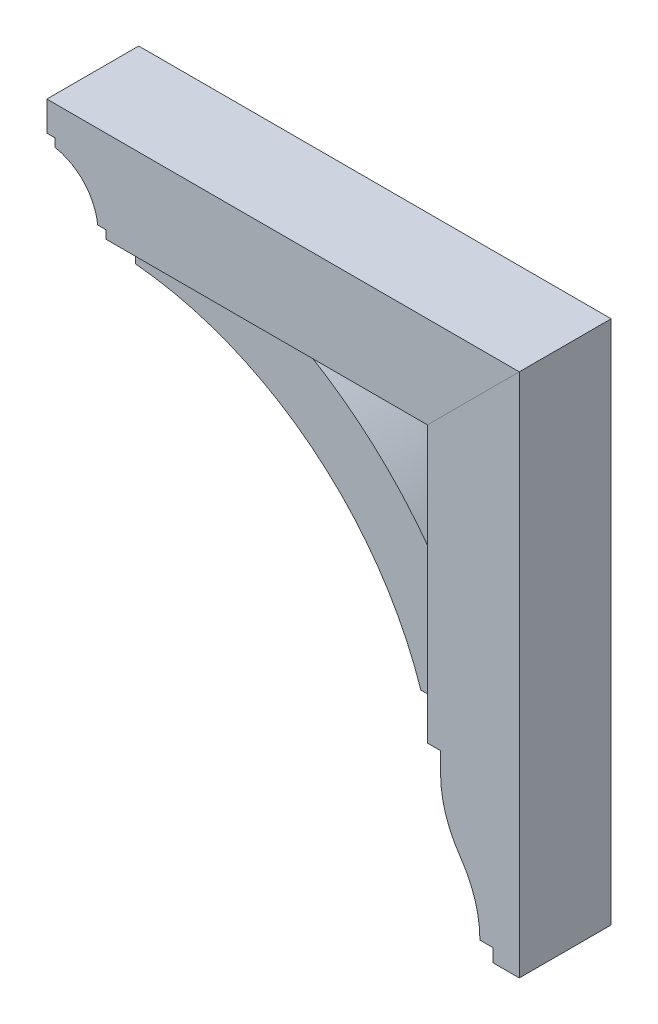
ISO-10303-21;
HEADER;
FILE_DESCRIPTION(('STEP AP214'),'2;1');
FILE_NAME('part.step','',(''),(''),'','','');
FILE_SCHEMA(('AUTOMOTIVE_DESIGN { 1 0 10303 214 1 1 1 1 }'));
ENDSEC;
DATA;
#1=APPLICATION_CONTEXT('core data for automotive mechanical design processes');
#2=APPLICATION_PROTOCOL_DEFINITION('international standard','automotive_design',2000,#1);
#3=PRODUCT_CONTEXT('',#1,'mechanical');
#4=PRODUCT('Part','Part','',(#3));
#5=PRODUCT_RELATED_PRODUCT_CATEGORY('part','',(#4));
#6=PRODUCT_DEFINITION_FORMATION('','',#4);
#7=PRODUCT_DEFINITION_CONTEXT('part definition',#1,'design');
#8=PRODUCT_DEFINITION('design','',#6,#7);
#9=PRODUCT_DEFINITION_SHAPE('','',#8);
#10=(LENGTH_UNIT() NAMED_UNIT(*) SI_UNIT(.MILLI.,.METRE.));
#11=(NAMED_UNIT(*) PLANE_ANGLE_UNIT() SI_UNIT($,.RADIAN.));
#12=(NAMED_UNIT(*) SI_UNIT($,.STERADIAN.) SOLID_ANGLE_UNIT());
#13=UNCERTAINTY_MEASURE_WITH_UNIT(LENGTH_MEASURE(1.E-05),#10,'distance_accuracy_value','');
#14=(GEOMETRIC_REPRESENTATION_CONTEXT(3) GLOBAL_UNCERTAINTY_ASSIGNED_CONTEXT((#13)) GLOBAL_UNIT_ASSIGNED_CONTEXT((#10,
#11,#12)) REPRESENTATION_CONTEXT('',''));
#15=CARTESIAN_POINT('',(0.,0.,0.));
#16=DIRECTION('',(0.,0.,1.));
#17=DIRECTION('',(1.,0.,0.));
#18=AXIS2_PLACEMENT_3D('',#15,#16,#17);
#19=CARTESIAN_POINT('',(246.881223015557,-1.07910715802948E-12,44.45));
#20=DIRECTION('',(1.,0.,0.));
#21=DIRECTION('',(0.,1.,0.));
#22=AXIS2_PLACEMENT_3D('',#19,#20,#21);
#23=PLANE('',#22);
#24=DIRECTION('',(0.,-1.,0.));
#25=VECTOR('',#24,1.);
#26=CARTESIAN_POINT('',(246.881223015557,-1.07910715802948E-12,-44.45));
#27=LINE('',#26,#25);
#28=CARTESIAN_POINT('',(246.881223015556,-183.515,-44.45));
#29=VERTEX_POINT('',#28);
#30=CARTESIAN_POINT('',(246.881223015556,-202.565,-44.45));
#31=VERTEX_POINT('',#30);
#32=EDGE_CURVE('E177',#29,#31,#27,.T.);
#33=ORIENTED_EDGE('',*,*,#32,.T.);
#34=DIRECTION('',(0.,0.,-1.));
#35=VECTOR('',#34,1.);
#36=CARTESIAN_POINT('',(246.881223015556,-202.565,44.45));
#37=LINE('',#36,#35);
#38=CARTESIAN_POINT('',(246.881223015556,-202.565,44.45));
#39=VERTEX_POINT('',#38);
#40=EDGE_CURVE('E12',#39,#31,#37,.T.);
#41=ORIENTED_EDGE('',*,*,#40,.F.);
#42=DIRECTION('',(0.,-1.,0.));
#43=VECTOR('',#42,1.);
#44=CARTESIAN_POINT('',(246.881223015557,-1.07910715802948E-12,44.45));
#45=LINE('',#44,#43);
#46=CARTESIAN_POINT('',(246.881223015556,-183.515,44.45));
#47=VERTEX_POINT('',#46);
#48=EDGE_CURVE('E209',#47,#39,#45,.T.);
#49=ORIENTED_EDGE('',*,*,#48,.F.);
#50=DIRECTION('',(0.,0.,-1.));
#51=VECTOR('',#50,1.);
#52=CARTESIAN_POINT('',(246.881223015556,-183.515,44.45));
#53=LINE('',#52,#51);
#54=EDGE_CURVE('E173',#47,#29,#53,.T.);
#55=ORIENTED_EDGE('',*,*,#54,.T.);
#56=EDGE_LOOP('',(#33,#41,#49,#55));
#57=FACE_BOUND('',#56,.T.);
#58=ADVANCED_FACE('F60',(#57),#23,.F.);
#59=CARTESIAN_POINT('',(351.656223015556,-202.565,44.45));
#60=DIRECTION('',(0.,0.,-1.));
#61=DIRECTION('',(-1.,0.,0.));
#62=AXIS2_PLACEMENT_3D('',#59,#60,#61);
#63=CYLINDRICAL_SURFACE('',#62,104.775);
#64=CARTESIAN_POINT('',(351.656223015556,-202.565,-44.45));
#65=DIRECTION('',(0.,0.,1.));
#66=DIRECTION('',(1.,0.,0.));
#67=AXIS2_PLACEMENT_3D('',#64,#65,#66);
#68=CIRCLE('',#67,104.775);
#69=CARTESIAN_POINT('',(265.883238128905,-262.73804785894,-44.45));
#70=VERTEX_POINT('',#69);
#71=EDGE_CURVE('E181',#31,#70,#68,.T.);
#72=ORIENTED_EDGE('',*,*,#71,.T.);
#73=DIRECTION('',(0.,0.,-1.));
#74=VECTOR('',#73,1.);
#75=CARTESIAN_POINT('',(265.883238128905,-262.73804785894,44.45));
#76=LINE('',#75,#74);
#77=CARTESIAN_POINT('',(265.883238128905,-262.73804785894,44.45));
#78=VERTEX_POINT('',#77);
#79=EDGE_CURVE('E69',#78,#70,#76,.T.);
#80=ORIENTED_EDGE('',*,*,#79,.F.);
#81=CARTESIAN_POINT('',(351.656223015556,-202.565,44.45));
#82=DIRECTION('',(0.,0.,1.));
#83=DIRECTION('',(1.,0.,0.));
#84=AXIS2_PLACEMENT_3D('',#81,#82,#83);
#85=CIRCLE('',#84,104.775);
#86=EDGE_CURVE('E126',#39,#78,#85,.T.);
#87=ORIENTED_EDGE('',*,*,#86,.F.);
#88=ORIENTED_EDGE('',*,*,#40,.T.);
#89=EDGE_LOOP('',(#72,#80,#87,#88));
#90=FACE_BOUND('',#89,.T.);
#91=ADVANCED_FACE('F235',(#90),#63,.T.);
#92=CARTESIAN_POINT('',(179.677056348882,-323.215,44.45));
#93=DIRECTION('',(0.,0.,-1.));
#94=DIRECTION('',(-1.,0.,0.));
#95=AXIS2_PLACEMENT_3D('',#92,#93,#94);
#96=CYLINDRICAL_SURFACE('',#95,105.304166666673);
#97=CARTESIAN_POINT('',(179.677056348882,-323.215,-44.45));
#98=DIRECTION('',(0.,0.,1.));
#99=DIRECTION('',(1.,0.,0.));
#100=AXIS2_PLACEMENT_3D('',#97,#98,#99);
#101=CIRCLE('',#100,105.304166666673);
#102=CARTESIAN_POINT('',(284.981223015555,-323.215,-44.45));
#103=VERTEX_POINT('',#102);
#104=EDGE_CURVE('E185',#103,#70,#101,.T.);
#105=ORIENTED_EDGE('',*,*,#104,.F.);
#106=DIRECTION('',(0.,0.,-1.));
#107=VECTOR('',#106,1.);
#108=CARTESIAN_POINT('',(284.981223015555,-323.215,44.45));
#109=LINE('',#108,#107);
#110=CARTESIAN_POINT('',(284.981223015555,-323.215,44.45));
#111=VERTEX_POINT('',#110);
#112=EDGE_CURVE('E225',#111,#103,#109,.T.);
#113=ORIENTED_EDGE('',*,*,#112,.F.);
#114=CARTESIAN_POINT('',(179.677056348882,-323.215,44.45));
#115=DIRECTION('',(0.,0.,1.));
#116=DIRECTION('',(1.,0.,0.));
#117=AXIS2_PLACEMENT_3D('',#114,#115,#116);
#118=CIRCLE('',#117,105.304166666673);
#119=EDGE_CURVE('E234',#111,#78,#118,.T.);
#120=ORIENTED_EDGE('',*,*,#119,.T.);
#121=ORIENTED_EDGE('',*,*,#79,.T.);
#122=EDGE_LOOP('',(#105,#113,#120,#121));
#123=FACE_BOUND('',#122,.T.);
#124=ADVANCED_FACE('F232',(#123),#96,.F.);
#125=CARTESIAN_POINT('',(0.,-323.215,44.45));
#126=DIRECTION('',(0.,-1.,0.));
#127=DIRECTION('',(0.,0.,-1.));
#128=AXIS2_PLACEMENT_3D('',#125,#126,#127);
#129=PLANE('',#128);
#130=DIRECTION('',(-1.,0.,0.));
#131=VECTOR('',#130,1.);
#132=CARTESIAN_POINT('',(0.,-323.215,-44.45));
#133=LINE('',#132,#131);
#134=CARTESIAN_POINT('',(297.681223015555,-323.215,-44.45));
#135=VERTEX_POINT('',#134);
#136=EDGE_CURVE('E189',#135,#103,#133,.T.);
#137=ORIENTED_EDGE('',*,*,#136,.F.);
#138=DIRECTION('',(0.,0.,-1.));
#139=VECTOR('',#138,1.);
#140=CARTESIAN_POINT('',(297.681223015555,-323.215,44.45));
#141=LINE('',#140,#139);
#142=CARTESIAN_POINT('',(297.681223015555,-323.215,44.45));
#143=VERTEX_POINT('',#142);
#144=EDGE_CURVE('E222',#143,#135,#141,.T.);
#145=ORIENTED_EDGE('',*,*,#144,.F.);
#146=DIRECTION('',(-1.,0.,0.));
#147=VECTOR('',#146,1.);
#148=CARTESIAN_POINT('',(0.,-323.215,44.45));
#149=LINE('',#148,#147);
#150=EDGE_CURVE('E246',#143,#111,#149,.T.);
#151=ORIENTED_EDGE('',*,*,#150,.T.);
#152=ORIENTED_EDGE('',*,*,#112,.T.);
#153=EDGE_LOOP('',(#137,#145,#151,#152));
#154=FACE_BOUND('',#153,.T.);
#155=ADVANCED_FACE('F243',(#154),#129,.T.);
#156=CARTESIAN_POINT('',(297.681223015555,0.,44.45));
#157=DIRECTION('',(-1.,0.,0.));
#158=DIRECTION('',(0.,0.,1.));
#159=AXIS2_PLACEMENT_3D('',#156,#157,#158);
#160=PLANE('',#159);
#161=DIRECTION('',(0.,1.,0.));
#162=VECTOR('',#161,1.);
#163=CARTESIAN_POINT('',(297.681223015555,0.,-44.45));
#164=LINE('',#163,#162);
#165=CARTESIAN_POINT('',(297.681223015555,-335.915,-44.45));
#166=VERTEX_POINT('',#165);
#167=EDGE_CURVE('E193',#166,#135,#164,.T.);
#168=ORIENTED_EDGE('',*,*,#167,.F.);
#169=DIRECTION('',(0.,0.,-1.));
#170=VECTOR('',#169,1.);
#171=CARTESIAN_POINT('',(297.681223015555,-335.915,44.45));
#172=LINE('',#171,#170);
#173=CARTESIAN_POINT('',(297.681223015555,-335.915,44.45));
#174=VERTEX_POINT('',#173);
#175=EDGE_CURVE('E219',#174,#166,#172,.T.);
#176=ORIENTED_EDGE('',*,*,#175,.F.);
#177=DIRECTION('',(0.,1.,0.));
#178=VECTOR('',#177,1.);
#179=CARTESIAN_POINT('',(297.681223015555,0.,44.45));
#180=LINE('',#179,#178);
#181=EDGE_CURVE('E253',#174,#143,#180,.T.);
#182=ORIENTED_EDGE('',*,*,#181,.T.);
#183=ORIENTED_EDGE('',*,*,#144,.T.);
#184=EDGE_LOOP('',(#168,#176,#182,#183));
#185=FACE_BOUND('',#184,.T.);
#186=ADVANCED_FACE('F300',(#185),#160,.T.);
#187=CARTESIAN_POINT('',(7.34134975033387E-13,-335.915000000001,44.45));
#188=DIRECTION('',(0.,-1.,0.));
#189=DIRECTION('',(1.,0.,0.));
#190=AXIS2_PLACEMENT_3D('',#187,#188,#189);
#191=PLANE('',#190);
#192=DIRECTION('',(-1.,0.,0.));
#193=VECTOR('',#192,1.);
#194=CARTESIAN_POINT('',(7.34134975033387E-13,-335.915000000001,-44.45));
#195=LINE('',#194,#193);
#196=CARTESIAN_POINT('',(323.081223015555,-335.915,-44.45));
#197=VERTEX_POINT('',#196);
#198=EDGE_CURVE('E197',#197,#166,#195,.T.);
#199=ORIENTED_EDGE('',*,*,#198,.F.);
#200=DIRECTION('',(0.,0.,-1.));
#201=VECTOR('',#200,1.);
#202=CARTESIAN_POINT('',(323.081223015555,-335.915,44.45));
#203=LINE('',#202,#201);
#204=CARTESIAN_POINT('',(323.081223015555,-335.915,44.45));
#205=VERTEX_POINT('',#204);
#206=EDGE_CURVE('E216',#205,#197,#203,.T.);
#207=ORIENTED_EDGE('',*,*,#206,.F.);
#208=DIRECTION('',(-1.,0.,0.));
#209=VECTOR('',#208,1.);
#210=CARTESIAN_POINT('',(7.34134975033387E-13,-335.915000000001,44.45));
#211=LINE('',#210,#209);
#212=EDGE_CURVE('E261',#205,#174,#211,.T.);
#213=ORIENTED_EDGE('',*,*,#212,.T.);
#214=ORIENTED_EDGE('',*,*,#175,.T.);
#215=EDGE_LOOP('',(#199,#207,#213,#214));
#216=FACE_BOUND('',#215,.T.);
#217=ADVANCED_FACE('F298',(#216),#191,.T.);
#218=CARTESIAN_POINT('',(323.081223015555,0.,44.45));
#219=DIRECTION('',(-1.,0.,0.));
#220=DIRECTION('',(0.,0.,1.));
#221=AXIS2_PLACEMENT_3D('',#218,#219,#220);
#222=PLANE('',#221);
#223=DIRECTION('',(0.,1.,0.));
#224=VECTOR('',#223,1.);
#225=CARTESIAN_POINT('',(323.081223015555,0.,-44.45));
#226=LINE('',#225,#224);
#227=CARTESIAN_POINT('',(323.081223015555,172.085,-44.45));
#228=VERTEX_POINT('',#227);
#229=EDGE_CURVE('E201',#197,#228,#226,.T.);
#230=ORIENTED_EDGE('',*,*,#229,.T.);
#231=DIRECTION('',(0.,0.,-1.));
#232=VECTOR('',#231,1.);
#233=CARTESIAN_POINT('',(323.081223015555,172.085,44.45));
#234=LINE('',#233,#232);
#235=CARTESIAN_POINT('',(323.081223015555,172.085,44.45));
#236=VERTEX_POINT('',#235);
#237=EDGE_CURVE('E163',#236,#228,#234,.T.);
#238=ORIENTED_EDGE('',*,*,#237,.F.);
#239=DIRECTION('',(0.,1.,0.));
#240=VECTOR('',#239,1.);
#241=CARTESIAN_POINT('',(323.081223015555,0.,44.45));
#242=LINE('',#241,#240);
#243=EDGE_CURVE('E152',#205,#236,#242,.T.);
#244=ORIENTED_EDGE('',*,*,#243,.F.);
#245=ORIENTED_EDGE('',*,*,#206,.T.);
#246=EDGE_LOOP('',(#230,#238,#244,#245));
#247=FACE_BOUND('',#246,.T.);
#248=ADVANCED_FACE('F307',(#247),#222,.F.);
#249=CARTESIAN_POINT('',(75.4981115077795,-75.4981115077785,44.45));
#250=DIRECTION('',(0.707106781186552,-0.707106781186543,0.));
#251=DIRECTION('',(0.707106781186543,0.707106781186552,0.));
#252=AXIS2_PLACEMENT_3D('',#249,#250,#251);
#253=PLANE('',#252);
#254=DIRECTION('',(-0.707106781186543,-0.707106781186552,0.));
#255=VECTOR('',#254,1.);
#256=CARTESIAN_POINT('',(75.4981115077795,-75.4981115077785,-44.45));
#257=LINE('',#256,#255);
#258=CARTESIAN_POINT('',(234.181223015556,83.1849999999999,-44.45));
#259=VERTEX_POINT('',#258);
#260=EDGE_CURVE('E161',#228,#259,#257,.T.);
#261=ORIENTED_EDGE('',*,*,#260,.T.);
#262=DIRECTION('',(0.,0.,-1.));
#263=VECTOR('',#262,1.);
#264=CARTESIAN_POINT('',(234.181223015556,83.1849999999999,44.45));
#265=LINE('',#264,#263);
#266=CARTESIAN_POINT('',(234.181223015556,83.1849999999999,44.45));
#267=VERTEX_POINT('',#266);
#268=EDGE_CURVE('E158',#267,#259,#265,.T.);
#269=ORIENTED_EDGE('',*,*,#268,.F.);
#270=DIRECTION('',(-0.707106781186543,-0.707106781186552,0.));
#271=VECTOR('',#270,1.);
#272=CARTESIAN_POINT('',(75.4981115077795,-75.4981115077785,44.45));
#273=LINE('',#272,#271);
#274=EDGE_CURVE('E145',#236,#267,#273,.T.);
#275=ORIENTED_EDGE('',*,*,#274,.F.);
#276=ORIENTED_EDGE('',*,*,#237,.T.);
#277=EDGE_LOOP('',(#261,#269,#275,#276));
#278=FACE_BOUND('',#277,.T.);
#279=ADVANCED_FACE('F159',(#278),#253,.F.);
#280=CARTESIAN_POINT('',(234.181223015556,0.,44.45));
#281=DIRECTION('',(1.,0.,0.));
#282=DIRECTION('',(0.,1.,0.));
#283=AXIS2_PLACEMENT_3D('',#280,#281,#282);
#284=PLANE('',#283);
#285=DIRECTION('',(0.,-1.,0.));
#286=VECTOR('',#285,1.);
#287=CARTESIAN_POINT('',(234.181223015556,0.,-44.45));
#288=LINE('',#287,#286);
#289=CARTESIAN_POINT('',(234.181223015556,-183.515,-44.45));
#290=VERTEX_POINT('',#289);
#291=EDGE_CURVE('E112',#259,#290,#288,.T.);
#292=ORIENTED_EDGE('',*,*,#291,.T.);
#293=DIRECTION('',(0.,0.,-1.));
#294=VECTOR('',#293,1.);
#295=CARTESIAN_POINT('',(234.181223015556,-183.515,44.45));
#296=LINE('',#295,#294);
#297=CARTESIAN_POINT('',(234.181223015556,-183.515,44.45));
#298=VERTEX_POINT('',#297);
#299=EDGE_CURVE('E164',#298,#290,#296,.T.);
#300=ORIENTED_EDGE('',*,*,#299,.F.);
#301=DIRECTION('',(0.,-1.,0.));
#302=VECTOR('',#301,1.);
#303=CARTESIAN_POINT('',(234.181223015556,0.,44.45));
#304=LINE('',#303,#302);
#305=EDGE_CURVE('E149',#267,#298,#304,.T.);
#306=ORIENTED_EDGE('',*,*,#305,.F.);
#307=ORIENTED_EDGE('',*,*,#268,.T.);
#308=EDGE_LOOP('',(#292,#300,#306,#307));
#309=FACE_BOUND('',#308,.T.);
#310=ADVANCED_FACE('F166',(#309),#284,.F.);
#311=CARTESIAN_POINT('',(0.,-183.515,44.45));
#312=DIRECTION('',(0.,1.,0.));
#313=DIRECTION('',(0.,0.,1.));
#314=AXIS2_PLACEMENT_3D('',#311,#312,#313);
#315=PLANE('',#314);
#316=DIRECTION('',(1.,0.,0.));
#317=VECTOR('',#316,1.);
#318=CARTESIAN_POINT('',(0.,-183.515,-44.45));
#319=LINE('',#318,#317);
#320=EDGE_CURVE('E118',#290,#29,#319,.T.);
#321=ORIENTED_EDGE('',*,*,#320,.T.);
#322=ORIENTED_EDGE('',*,*,#54,.F.);
#323=DIRECTION('',(1.,0.,0.));
#324=VECTOR('',#323,1.);
#325=CARTESIAN_POINT('',(0.,-183.515,44.45));
#326=LINE('',#325,#324);
#327=EDGE_CURVE('E77',#298,#47,#326,.T.);
#328=ORIENTED_EDGE('',*,*,#327,.F.);
#329=ORIENTED_EDGE('',*,*,#299,.T.);
#330=EDGE_LOOP('',(#321,#322,#328,#329));
#331=FACE_BOUND('',#330,.T.);
#332=ADVANCED_FACE('F347',(#331),#315,.F.);
#333=CARTESIAN_POINT('',(0.,0.,44.45));
#334=DIRECTION('',(0.,0.,1.));
#335=DIRECTION('',(1.,0.,0.));
#336=AXIS2_PLACEMENT_3D('',#333,#334,#335);
#337=PLANE('',#336);
#338=ORIENTED_EDGE('',*,*,#48,.T.);
#339=ORIENTED_EDGE('',*,*,#86,.T.);
#340=ORIENTED_EDGE('',*,*,#119,.F.);
#341=ORIENTED_EDGE('',*,*,#150,.F.);
#342=ORIENTED_EDGE('',*,*,#181,.F.);
#343=ORIENTED_EDGE('',*,*,#212,.F.);
#344=ORIENTED_EDGE('',*,*,#243,.T.);
#345=ORIENTED_EDGE('',*,*,#274,.T.);
#346=ORIENTED_EDGE('',*,*,#305,.T.);
#347=ORIENTED_EDGE('',*,*,#327,.T.);
#348=EDGE_LOOP('',(#338,#339,#340,#341,#342,#343,#344,#345,#346,#347));
#349=FACE_BOUND('',#348,.T.);
#350=ADVANCED_FACE('F147',(#349),#337,.T.);
#351=CARTESIAN_POINT('',(0.,0.,-44.45));
#352=DIRECTION('',(0.,0.,1.));
#353=DIRECTION('',(1.,0.,0.));
#354=AXIS2_PLACEMENT_3D('',#351,#352,#353);
#355=PLANE('',#354);
#356=ORIENTED_EDGE('',*,*,#32,.F.);
#357=ORIENTED_EDGE('',*,*,#320,.F.);
#358=ORIENTED_EDGE('',*,*,#291,.F.);
#359=ORIENTED_EDGE('',*,*,#260,.F.);
#360=ORIENTED_EDGE('',*,*,#229,.F.);
#361=ORIENTED_EDGE('',*,*,#198,.T.);
#362=ORIENTED_EDGE('',*,*,#167,.T.);
#363=ORIENTED_EDGE('',*,*,#136,.T.);
#364=ORIENTED_EDGE('',*,*,#104,.T.);
#365=ORIENTED_EDGE('',*,*,#71,.F.);
#366=EDGE_LOOP('',(#356,#357,#358,#359,#360,#361,#362,#363,#364,#365));
#367=FACE_BOUND('',#366,.T.);
#368=ADVANCED_FACE('F239',(#367),#355,.F.);
#369=CLOSED_SHELL('',(#58,#91,#124,#155,#186,#217,#248,#279,#310,#332,#350,#368));
#370=MANIFOLD_SOLID_BREP('B2',#369);
#371=CARTESIAN_POINT('',(-87.6097995640086,-258.436901533975,31.75));
#372=DIRECTION('',(0.,0.,-1.));
#373=DIRECTION('',(-1.,0.,0.));
#374=AXIS2_PLACEMENT_3D('',#371,#372,#373);
#375=CYLINDRICAL_SURFACE('',#374,384.175);
#376=CARTESIAN_POINT('',(-87.6097995640086,-258.436901533975,-31.75));
#377=DIRECTION('',(0.,0.,1.));
#378=DIRECTION('',(1.,0.,0.));
#379=AXIS2_PLACEMENT_3D('',#376,#377,#378);
#380=CIRCLE('',#379,384.175);
#381=CARTESIAN_POINT('',(88.1312230155558,83.1849999999999,-31.75));
#382=VERTEX_POINT('',#381);
#383=CARTESIAN_POINT('',(234.181223015556,-48.5775000000002,-31.75));
#384=VERTEX_POINT('',#383);
#385=EDGE_CURVE('E522',#382,#384,#380,.F.);
#386=ORIENTED_EDGE('',*,*,#385,.F.);
#387=DIRECTION('',(0.,0.,-1.));
#388=VECTOR('',#387,1.);
#389=CARTESIAN_POINT('',(88.1312230155558,83.1849999999999,31.75));
#390=LINE('',#389,#388);
#391=CARTESIAN_POINT('',(88.1312230155558,83.1849999999999,31.75));
#392=VERTEX_POINT('',#391);
#393=EDGE_CURVE('E58',#392,#382,#390,.T.);
#394=ORIENTED_EDGE('',*,*,#393,.F.);
#395=CARTESIAN_POINT('',(-87.6097995640086,-258.436901533975,31.75));
#396=DIRECTION('',(0.,0.,1.));
#397=DIRECTION('',(1.,0.,0.));
#398=AXIS2_PLACEMENT_3D('',#395,#396,#397);
#399=CIRCLE('',#398,384.175);
#400=CARTESIAN_POINT('',(234.181223015556,-48.5775000000002,31.75));
#401=VERTEX_POINT('',#400);
#402=EDGE_CURVE('E540',#392,#401,#399,.F.);
#403=ORIENTED_EDGE('',*,*,#402,.T.);
#404=DIRECTION('',(0.,0.,-1.));
#405=VECTOR('',#404,1.);
#406=CARTESIAN_POINT('',(234.181223015556,-48.5775000000002,31.75));
#407=LINE('',#406,#405);
#408=EDGE_CURVE('E450',#401,#384,#407,.T.);
#409=ORIENTED_EDGE('',*,*,#408,.T.);
#410=EDGE_LOOP('',(#386,#394,#403,#409));
#411=FACE_BOUND('',#410,.T.);
#412=ADVANCED_FACE('F433',(#411),#375,.T.);
#413=CARTESIAN_POINT('',(0.,83.1849999999999,31.75));
#414=DIRECTION('',(0.,1.,0.));
#415=DIRECTION('',(-1.,0.,0.));
#416=AXIS2_PLACEMENT_3D('',#413,#414,#415);
#417=PLANE('',#416);
#418=DIRECTION('',(1.,0.,0.));
#419=VECTOR('',#418,1.);
#420=CARTESIAN_POINT('',(0.,83.1849999999999,-31.75));
#421=LINE('',#420,#419);
#422=CARTESIAN_POINT('',(-61.0937769844451,83.1849999999998,-31.75));
#423=VERTEX_POINT('',#422);
#424=EDGE_CURVE('E525',#423,#382,#421,.T.);
#425=ORIENTED_EDGE('',*,*,#424,.F.);
#426=DIRECTION('',(0.,0.,-1.));
#427=VECTOR('',#426,1.);
#428=CARTESIAN_POINT('',(-61.0937769844451,83.1849999999998,31.75));
#429=LINE('',#428,#427);
#430=CARTESIAN_POINT('',(-61.0937769844451,83.1849999999998,31.75));
#431=VERTEX_POINT('',#430);
#432=EDGE_CURVE('E442',#431,#423,#429,.T.);
#433=ORIENTED_EDGE('',*,*,#432,.F.);
#434=DIRECTION('',(1.,0.,0.));
#435=VECTOR('',#434,1.);
#436=CARTESIAN_POINT('',(0.,83.1849999999999,31.75));
#437=LINE('',#436,#435);
#438=EDGE_CURVE('E555',#431,#392,#437,.T.);
#439=ORIENTED_EDGE('',*,*,#438,.T.);
#440=ORIENTED_EDGE('',*,*,#393,.T.);
#441=EDGE_LOOP('',(#425,#433,#439,#440));
#442=FACE_BOUND('',#441,.T.);
#443=ADVANCED_FACE('F554',(#442),#417,.T.);
#444=CARTESIAN_POINT('',(-61.0937769844451,0.,31.75));
#445=DIRECTION('',(1.,0.,0.));
#446=DIRECTION('',(0.,1.,0.));
#447=AXIS2_PLACEMENT_3D('',#444,#445,#446);
#448=PLANE('',#447);
#449=DIRECTION('',(0.,-1.,0.));
#450=VECTOR('',#449,1.);
#451=CARTESIAN_POINT('',(-61.0937769844451,0.,-31.75));
#452=LINE('',#451,#450);
#453=CARTESIAN_POINT('',(-61.0937769844451,64.1349999999998,-31.75));
#454=VERTEX_POINT('',#453);
#455=EDGE_CURVE('E528',#423,#454,#452,.T.);
#456=ORIENTED_EDGE('',*,*,#455,.T.);
#457=DIRECTION('',(0.,0.,-1.));
#458=VECTOR('',#457,1.);
#459=CARTESIAN_POINT('',(-61.0937769844451,64.1349999999998,31.75));
#460=LINE('',#459,#458);
#461=CARTESIAN_POINT('',(-61.0937769844451,64.1349999999998,31.75));
#462=VERTEX_POINT('',#461);
#463=EDGE_CURVE('E510',#462,#454,#460,.T.);
#464=ORIENTED_EDGE('',*,*,#463,.F.);
#465=DIRECTION('',(0.,-1.,0.));
#466=VECTOR('',#465,1.);
#467=CARTESIAN_POINT('',(-61.0937769844451,0.,31.75));
#468=LINE('',#467,#466);
#469=EDGE_CURVE('E496',#431,#462,#468,.T.);
#470=ORIENTED_EDGE('',*,*,#469,.F.);
#471=ORIENTED_EDGE('',*,*,#432,.T.);
#472=EDGE_LOOP('',(#456,#464,#470,#471));
#473=FACE_BOUND('',#472,.T.);
#474=ADVANCED_FACE('F548',(#473),#448,.F.);
#475=CARTESIAN_POINT('',(-90.6192348785118,-256.772099083825,31.75));
#476=DIRECTION('',(0.,0.,-1.));
#477=DIRECTION('',(-1.,0.,0.));
#478=AXIS2_PLACEMENT_3D('',#475,#476,#477);
#479=CYLINDRICAL_SURFACE('',#478,322.2625);
#480=CARTESIAN_POINT('',(-90.6192348785118,-256.772099083825,-31.75));
#481=DIRECTION('',(0.,0.,1.));
#482=DIRECTION('',(1.,0.,0.));
#483=AXIS2_PLACEMENT_3D('',#480,#481,#482);
#484=CIRCLE('',#483,322.2625);
#485=CARTESIAN_POINT('',(215.131223015556,-154.94,-31.75));
#486=VERTEX_POINT('',#485);
#487=EDGE_CURVE('E506',#454,#486,#484,.F.);
#488=ORIENTED_EDGE('',*,*,#487,.T.);
#489=DIRECTION('',(0.,0.,-1.));
#490=VECTOR('',#489,1.);
#491=CARTESIAN_POINT('',(215.131223015556,-154.94,31.75));
#492=LINE('',#491,#490);
#493=CARTESIAN_POINT('',(215.131223015556,-154.94,31.75));
#494=VERTEX_POINT('',#493);
#495=EDGE_CURVE('E503',#494,#486,#492,.T.);
#496=ORIENTED_EDGE('',*,*,#495,.F.);
#497=CARTESIAN_POINT('',(-90.6192348785118,-256.772099083825,31.75));
#498=DIRECTION('',(0.,0.,1.));
#499=DIRECTION('',(1.,0.,0.));
#500=AXIS2_PLACEMENT_3D('',#497,#498,#499);
#501=CIRCLE('',#500,322.2625);
#502=EDGE_CURVE('E488',#462,#494,#501,.F.);
#503=ORIENTED_EDGE('',*,*,#502,.F.);
#504=ORIENTED_EDGE('',*,*,#463,.T.);
#505=EDGE_LOOP('',(#488,#496,#503,#504));
#506=FACE_BOUND('',#505,.T.);
#507=ADVANCED_FACE('F504',(#506),#479,.F.);
#508=CARTESIAN_POINT('',(-2.25745348340448E-13,-154.94,31.75));
#509=DIRECTION('',(0.,-1.,0.));
#510=DIRECTION('',(1.,0.,0.));
#511=AXIS2_PLACEMENT_3D('',#508,#509,#510);
#512=PLANE('',#511);
#513=DIRECTION('',(-1.,0.,0.));
#514=VECTOR('',#513,1.);
#515=CARTESIAN_POINT('',(-2.25745348340448E-13,-154.94,-31.75));
#516=LINE('',#515,#514);
#517=CARTESIAN_POINT('',(234.181223015556,-154.94,-31.75));
#518=VERTEX_POINT('',#517);
#519=EDGE_CURVE('E533',#518,#486,#516,.T.);
#520=ORIENTED_EDGE('',*,*,#519,.F.);
#521=DIRECTION('',(0.,0.,-1.));
#522=VECTOR('',#521,1.);
#523=CARTESIAN_POINT('',(234.181223015556,-154.94,31.75));
#524=LINE('',#523,#522);
#525=CARTESIAN_POINT('',(234.181223015556,-154.94,31.75));
#526=VERTEX_POINT('',#525);
#527=EDGE_CURVE('E469',#526,#518,#524,.T.);
#528=ORIENTED_EDGE('',*,*,#527,.F.);
#529=DIRECTION('',(-1.,0.,0.));
#530=VECTOR('',#529,1.);
#531=CARTESIAN_POINT('',(-2.25745348340448E-13,-154.94,31.75));
#532=LINE('',#531,#530);
#533=EDGE_CURVE('E493',#526,#494,#532,.T.);
#534=ORIENTED_EDGE('',*,*,#533,.T.);
#535=ORIENTED_EDGE('',*,*,#495,.T.);
#536=EDGE_LOOP('',(#520,#528,#534,#535));
#537=FACE_BOUND('',#536,.T.);
#538=ADVANCED_FACE('F512',(#537),#512,.T.);
#539=CARTESIAN_POINT('',(234.181223015556,0.,31.75));
#540=DIRECTION('',(1.,0.,0.));
#541=DIRECTION('',(0.,1.,0.));
#542=AXIS2_PLACEMENT_3D('',#539,#540,#541);
#543=PLANE('',#542);
#544=DIRECTION('',(0.,-1.,0.));
#545=VECTOR('',#544,1.);
#546=CARTESIAN_POINT('',(234.181223015556,0.,-31.75));
#547=LINE('',#546,#545);
#548=EDGE_CURVE('E536',#384,#518,#547,.T.);
#549=ORIENTED_EDGE('',*,*,#548,.F.);
#550=ORIENTED_EDGE('',*,*,#408,.F.);
#551=DIRECTION('',(0.,-1.,0.));
#552=VECTOR('',#551,1.);
#553=CARTESIAN_POINT('',(234.181223015556,0.,31.75));
#554=LINE('',#553,#552);
#555=EDGE_CURVE('E514',#401,#526,#554,.T.);
#556=ORIENTED_EDGE('',*,*,#555,.T.);
#557=ORIENTED_EDGE('',*,*,#527,.T.);
#558=EDGE_LOOP('',(#549,#550,#556,#557));
#559=FACE_BOUND('',#558,.T.);
#560=ADVANCED_FACE('F556',(#559),#543,.T.);
#561=CARTESIAN_POINT('',(0.,0.,31.75));
#562=DIRECTION('',(0.,0.,1.));
#563=DIRECTION('',(1.,0.,0.));
#564=AXIS2_PLACEMENT_3D('',#561,#562,#563);
#565=PLANE('',#564);
#566=ORIENTED_EDGE('',*,*,#402,.F.);
#567=ORIENTED_EDGE('',*,*,#438,.F.);
#568=ORIENTED_EDGE('',*,*,#469,.T.);
#569=ORIENTED_EDGE('',*,*,#502,.T.);
#570=ORIENTED_EDGE('',*,*,#533,.F.);
#571=ORIENTED_EDGE('',*,*,#555,.F.);
#572=EDGE_LOOP('',(#566,#567,#568,#569,#570,#571));
#573=FACE_BOUND('',#572,.T.);
#574=ADVANCED_FACE('F490',(#573),#565,.T.);
#575=CARTESIAN_POINT('',(0.,0.,-31.75));
#576=DIRECTION('',(0.,0.,1.));
#577=DIRECTION('',(1.,0.,0.));
#578=AXIS2_PLACEMENT_3D('',#575,#576,#577);
#579=PLANE('',#578);
#580=ORIENTED_EDGE('',*,*,#385,.T.);
#581=ORIENTED_EDGE('',*,*,#548,.T.);
#582=ORIENTED_EDGE('',*,*,#519,.T.);
#583=ORIENTED_EDGE('',*,*,#487,.F.);
#584=ORIENTED_EDGE('',*,*,#455,.F.);
#585=ORIENTED_EDGE('',*,*,#424,.T.);
#586=EDGE_LOOP('',(#580,#581,#582,#583,#584,#585));
#587=FACE_BOUND('',#586,.T.);
#588=ADVANCED_FACE('F553',(#587),#579,.F.);
#589=CLOSED_SHELL('',(#412,#443,#474,#507,#538,#560,#574,#588));
#590=MANIFOLD_SOLID_BREP('B6',#589);
#591=CARTESIAN_POINT('',(-126.181276984445,0.,44.45));
#592=DIRECTION('',(-1.,0.,0.));
#593=DIRECTION('',(0.,0.,1.));
#594=AXIS2_PLACEMENT_3D('',#591,#592,#593);
#595=PLANE('',#594);
#596=DIRECTION('',(0.,1.,0.));
#597=VECTOR('',#596,1.);
#598=CARTESIAN_POINT('',(-126.181276984445,0.,-44.45));
#599=LINE('',#598,#597);
#600=CARTESIAN_POINT('',(-126.181276984445,135.5725,-44.45));
#601=VERTEX_POINT('',#600);
#602=CARTESIAN_POINT('',(-126.181276984445,143.51,-44.45));
#603=VERTEX_POINT('',#602);
#604=EDGE_CURVE('E748',#601,#603,#599,.T.);
#605=ORIENTED_EDGE('',*,*,#604,.F.);
#606=DIRECTION('',(0.,0.,-1.));
#607=VECTOR('',#606,1.);
#608=CARTESIAN_POINT('',(-126.181276984445,135.5725,44.45));
#609=LINE('',#608,#607);
#610=CARTESIAN_POINT('',(-126.181276984445,135.5725,44.45));
#611=VERTEX_POINT('',#610);
#612=EDGE_CURVE('E431',#611,#601,#609,.T.);
#613=ORIENTED_EDGE('',*,*,#612,.F.);
#614=DIRECTION('',(0.,1.,0.));
#615=VECTOR('',#614,1.);
#616=CARTESIAN_POINT('',(-126.181276984445,0.,44.45));
#617=LINE('',#616,#615);
#618=CARTESIAN_POINT('',(-126.181276984445,143.51,44.45));
#619=VERTEX_POINT('',#618);
#620=EDGE_CURVE('E779',#611,#619,#617,.T.);
#621=ORIENTED_EDGE('',*,*,#620,.T.);
#622=DIRECTION('',(0.,0.,-1.));
#623=VECTOR('',#622,1.);
#624=CARTESIAN_POINT('',(-126.181276984445,143.51,44.45));
#625=LINE('',#624,#623);
#626=EDGE_CURVE('E660',#619,#603,#625,.T.);
#627=ORIENTED_EDGE('',*,*,#626,.T.);
#628=EDGE_LOOP('',(#605,#613,#621,#627));
#629=FACE_BOUND('',#628,.T.);
#630=ADVANCED_FACE('F643',(#629),#595,.T.);
#631=CARTESIAN_POINT('',(-135.346246273317,85.6737785174764,44.45));
#632=DIRECTION('',(0.,0.,-1.));
#633=DIRECTION('',(-1.,0.,0.));
#634=AXIS2_PLACEMENT_3D('',#631,#632,#633);
#635=CYLINDRICAL_SURFACE('',#634,50.7334117486339);
#636=CARTESIAN_POINT('',(-135.346246273317,85.6737785174764,-44.45));
#637=DIRECTION('',(0.,0.,1.));
#638=DIRECTION('',(1.,0.,0.));
#639=AXIS2_PLACEMENT_3D('',#636,#637,#638);
#640=CIRCLE('',#639,50.7334117486339);
#641=CARTESIAN_POINT('',(-84.9062769844451,91.1224999999999,-44.45));
#642=VERTEX_POINT('',#641);
#643=EDGE_CURVE('E751',#601,#642,#640,.F.);
#644=ORIENTED_EDGE('',*,*,#643,.T.);
#645=DIRECTION('',(0.,0.,-1.));
#646=VECTOR('',#645,1.);
#647=CARTESIAN_POINT('',(-84.9062769844451,91.1224999999999,44.45));
#648=LINE('',#647,#646);
#649=CARTESIAN_POINT('',(-84.9062769844451,91.1224999999999,44.45));
#650=VERTEX_POINT('',#649);
#651=EDGE_CURVE('E652',#650,#642,#648,.T.);
#652=ORIENTED_EDGE('',*,*,#651,.F.);
#653=CARTESIAN_POINT('',(-135.346246273317,85.6737785174764,44.45));
#654=DIRECTION('',(0.,0.,1.));
#655=DIRECTION('',(1.,0.,0.));
#656=AXIS2_PLACEMENT_3D('',#653,#654,#655);
#657=CIRCLE('',#656,50.7334117486339);
#658=EDGE_CURVE('E816',#611,#650,#657,.F.);
#659=ORIENTED_EDGE('',*,*,#658,.F.);
#660=ORIENTED_EDGE('',*,*,#612,.T.);
#661=EDGE_LOOP('',(#644,#652,#659,#660));
#662=FACE_BOUND('',#661,.T.);
#663=ADVANCED_FACE('F805',(#662),#635,.F.);
#664=CARTESIAN_POINT('',(1.59317004033709E-13,91.1224999999997,44.45));
#665=DIRECTION('',(0.,-1.,0.));
#666=DIRECTION('',(1.,0.,0.));
#667=AXIS2_PLACEMENT_3D('',#664,#665,#666);
#668=PLANE('',#667);
#669=DIRECTION('',(-1.,0.,0.));
#670=VECTOR('',#669,1.);
#671=CARTESIAN_POINT('',(1.59317004033709E-13,91.1224999999997,-44.45));
#672=LINE('',#671,#670);
#673=CARTESIAN_POINT('',(-76.9687769844451,91.1224999999998,-44.45));
#674=VERTEX_POINT('',#673);
#675=EDGE_CURVE('E754',#674,#642,#672,.T.);
#676=ORIENTED_EDGE('',*,*,#675,.F.);
#677=DIRECTION('',(0.,0.,-1.));
#678=VECTOR('',#677,1.);
#679=CARTESIAN_POINT('',(-76.9687769844451,91.1224999999998,44.45));
#680=LINE('',#679,#678);
#681=CARTESIAN_POINT('',(-76.9687769844451,91.1224999999998,44.45));
#682=VERTEX_POINT('',#681);
#683=EDGE_CURVE('E792',#682,#674,#680,.T.);
#684=ORIENTED_EDGE('',*,*,#683,.F.);
#685=DIRECTION('',(-1.,0.,0.));
#686=VECTOR('',#685,1.);
#687=CARTESIAN_POINT('',(1.59317004033709E-13,91.1224999999997,44.45));
#688=LINE('',#687,#686);
#689=EDGE_CURVE('E802',#682,#650,#688,.T.);
#690=ORIENTED_EDGE('',*,*,#689,.T.);
#691=ORIENTED_EDGE('',*,*,#651,.T.);
#692=EDGE_LOOP('',(#676,#684,#690,#691));
#693=FACE_BOUND('',#692,.T.);
#694=ADVANCED_FACE('F800',(#693),#668,.T.);
#695=CARTESIAN_POINT('',(-76.9687769844451,0.,44.45));
#696=DIRECTION('',(-1.,0.,0.));
#697=DIRECTION('',(0.,0.,1.));
#698=AXIS2_PLACEMENT_3D('',#695,#696,#697);
#699=PLANE('',#698);
#700=DIRECTION('',(0.,1.,0.));
#701=VECTOR('',#700,1.);
#702=CARTESIAN_POINT('',(-76.9687769844451,0.,-44.45));
#703=LINE('',#702,#701);
#704=CARTESIAN_POINT('',(-76.9687769844451,83.1849999999998,-44.45));
#705=VERTEX_POINT('',#704);
#706=EDGE_CURVE('E758',#705,#674,#703,.T.);
#707=ORIENTED_EDGE('',*,*,#706,.F.);
#708=DIRECTION('',(0.,0.,-1.));
#709=VECTOR('',#708,1.);
#710=CARTESIAN_POINT('',(-76.9687769844451,83.1849999999998,44.45));
#711=LINE('',#710,#709);
#712=CARTESIAN_POINT('',(-76.9687769844451,83.1849999999998,44.45));
#713=VERTEX_POINT('',#712);
#714=EDGE_CURVE('E789',#713,#705,#711,.T.);
#715=ORIENTED_EDGE('',*,*,#714,.F.);
#716=DIRECTION('',(0.,1.,0.));
#717=VECTOR('',#716,1.);
#718=CARTESIAN_POINT('',(-76.9687769844451,0.,44.45));
#719=LINE('',#718,#717);
#720=EDGE_CURVE('E815',#713,#682,#719,.T.);
#721=ORIENTED_EDGE('',*,*,#720,.T.);
#722=ORIENTED_EDGE('',*,*,#683,.T.);
#723=EDGE_LOOP('',(#707,#715,#721,#722));
#724=FACE_BOUND('',#723,.T.);
#725=ADVANCED_FACE('F811',(#724),#699,.T.);
#726=CARTESIAN_POINT('',(0.,83.1849999999999,44.45));
#727=DIRECTION('',(0.,1.,0.));
#728=DIRECTION('',(-1.,0.,0.));
#729=AXIS2_PLACEMENT_3D('',#726,#727,#728);
#730=PLANE('',#729);
#731=DIRECTION('',(1.,0.,0.));
#732=VECTOR('',#731,1.);
#733=CARTESIAN_POINT('',(0.,83.1849999999999,-44.45));
#734=LINE('',#733,#732);
#735=CARTESIAN_POINT('',(234.181223015556,83.1849999999999,-44.45));
#736=VERTEX_POINT('',#735);
#737=EDGE_CURVE('E762',#705,#736,#734,.T.);
#738=ORIENTED_EDGE('',*,*,#737,.T.);
#739=DIRECTION('',(0.,0.,-1.));
#740=VECTOR('',#739,1.);
#741=CARTESIAN_POINT('',(234.181223015556,83.1849999999999,44.45));
#742=LINE('',#741,#740);
#743=CARTESIAN_POINT('',(234.181223015556,83.1849999999999,44.45));
#744=VERTEX_POINT('',#743);
#745=EDGE_CURVE('E786',#744,#736,#742,.T.);
#746=ORIENTED_EDGE('',*,*,#745,.F.);
#747=DIRECTION('',(1.,0.,0.));
#748=VECTOR('',#747,1.);
#749=CARTESIAN_POINT('',(0.,83.1849999999999,44.45));
#750=LINE('',#749,#748);
#751=EDGE_CURVE('E820',#713,#744,#750,.T.);
#752=ORIENTED_EDGE('',*,*,#751,.F.);
#753=ORIENTED_EDGE('',*,*,#714,.T.);
#754=EDGE_LOOP('',(#738,#746,#752,#753));
#755=FACE_BOUND('',#754,.T.);
#756=ADVANCED_FACE('F852',(#755),#730,.F.);
#757=CARTESIAN_POINT('',(75.4981115077795,-75.4981115077785,44.45));
#758=DIRECTION('',(0.707106781186552,-0.707106781186543,0.));
#759=DIRECTION('',(0.707106781186543,0.707106781186552,0.));
#760=AXIS2_PLACEMENT_3D('',#757,#758,#759);
#761=PLANE('',#760);
#762=DIRECTION('',(-0.707106781186543,-0.707106781186552,0.));
#763=VECTOR('',#762,1.);
#764=CARTESIAN_POINT('',(75.4981115077795,-75.4981115077785,-44.45));
#765=LINE('',#764,#763);
#766=CARTESIAN_POINT('',(323.081223015555,172.085,-44.45));
#767=VERTEX_POINT('',#766);
#768=EDGE_CURVE('E766',#767,#736,#765,.T.);
#769=ORIENTED_EDGE('',*,*,#768,.F.);
#770=DIRECTION('',(0.,0.,-1.));
#771=VECTOR('',#770,1.);
#772=CARTESIAN_POINT('',(323.081223015555,172.085,44.45));
#773=LINE('',#772,#771);
#774=CARTESIAN_POINT('',(323.081223015555,172.085,44.45));
#775=VERTEX_POINT('',#774);
#776=EDGE_CURVE('E737',#775,#767,#773,.T.);
#777=ORIENTED_EDGE('',*,*,#776,.F.);
#778=DIRECTION('',(-0.707106781186543,-0.707106781186552,0.));
#779=VECTOR('',#778,1.);
#780=CARTESIAN_POINT('',(75.4981115077795,-75.4981115077785,44.45));
#781=LINE('',#780,#779);
#782=EDGE_CURVE('E725',#775,#744,#781,.T.);
#783=ORIENTED_EDGE('',*,*,#782,.T.);
#784=ORIENTED_EDGE('',*,*,#745,.T.);
#785=EDGE_LOOP('',(#769,#777,#783,#784));
#786=FACE_BOUND('',#785,.T.);
#787=ADVANCED_FACE('F829',(#786),#761,.T.);
#788=CARTESIAN_POINT('',(0.,172.085,44.45));
#789=DIRECTION('',(0.,-1.,0.));
#790=DIRECTION('',(0.,0.,-1.));
#791=AXIS2_PLACEMENT_3D('',#788,#789,#790);
#792=PLANE('',#791);
#793=DIRECTION('',(-1.,0.,0.));
#794=VECTOR('',#793,1.);
#795=CARTESIAN_POINT('',(0.,172.085,-44.45));
#796=LINE('',#795,#794);
#797=CARTESIAN_POINT('',(-134.118776984445,172.085,-44.45));
#798=VERTEX_POINT('',#797);
#799=EDGE_CURVE('E733',#767,#798,#796,.T.);
#800=ORIENTED_EDGE('',*,*,#799,.T.);
#801=DIRECTION('',(0.,0.,-1.));
#802=VECTOR('',#801,1.);
#803=CARTESIAN_POINT('',(-134.118776984445,172.085,44.45));
#804=LINE('',#803,#802);
#805=CARTESIAN_POINT('',(-134.118776984445,172.085,44.45));
#806=VERTEX_POINT('',#805);
#807=EDGE_CURVE('E730',#806,#798,#804,.T.);
#808=ORIENTED_EDGE('',*,*,#807,.F.);
#809=DIRECTION('',(-1.,0.,0.));
#810=VECTOR('',#809,1.);
#811=CARTESIAN_POINT('',(0.,172.085,44.45));
#812=LINE('',#811,#810);
#813=EDGE_CURVE('E717',#775,#806,#812,.T.);
#814=ORIENTED_EDGE('',*,*,#813,.F.);
#815=ORIENTED_EDGE('',*,*,#776,.T.);
#816=EDGE_LOOP('',(#800,#808,#814,#815));
#817=FACE_BOUND('',#816,.T.);
#818=ADVANCED_FACE('F731',(#817),#792,.F.);
#819=CARTESIAN_POINT('',(-134.118776984445,0.,44.45));
#820=DIRECTION('',(1.,0.,0.));
#821=DIRECTION('',(0.,0.,-1.));
#822=AXIS2_PLACEMENT_3D('',#819,#820,#821);
#823=PLANE('',#822);
#824=DIRECTION('',(0.,-1.,0.));
#825=VECTOR('',#824,1.);
#826=CARTESIAN_POINT('',(-134.118776984445,0.,-44.45));
#827=LINE('',#826,#825);
#828=CARTESIAN_POINT('',(-134.118776984445,143.51,-44.45));
#829=VERTEX_POINT('',#828);
#830=EDGE_CURVE('E772',#798,#829,#827,.T.);
#831=ORIENTED_EDGE('',*,*,#830,.T.);
#832=DIRECTION('',(0.,0.,-1.));
#833=VECTOR('',#832,1.);
#834=CARTESIAN_POINT('',(-134.118776984445,143.51,44.45));
#835=LINE('',#834,#833);
#836=CARTESIAN_POINT('',(-134.118776984445,143.51,44.45));
#837=VERTEX_POINT('',#836);
#838=EDGE_CURVE('E689',#837,#829,#835,.T.);
#839=ORIENTED_EDGE('',*,*,#838,.F.);
#840=DIRECTION('',(0.,-1.,0.));
#841=VECTOR('',#840,1.);
#842=CARTESIAN_POINT('',(-134.118776984445,0.,44.45));
#843=LINE('',#842,#841);
#844=EDGE_CURVE('E723',#806,#837,#843,.T.);
#845=ORIENTED_EDGE('',*,*,#844,.F.);
#846=ORIENTED_EDGE('',*,*,#807,.T.);
#847=EDGE_LOOP('',(#831,#839,#845,#846));
#848=FACE_BOUND('',#847,.T.);
#849=ADVANCED_FACE('F739',(#848),#823,.F.);
#850=CARTESIAN_POINT('',(0.,143.51,44.45));
#851=DIRECTION('',(0.,-1.,0.));
#852=DIRECTION('',(0.,0.,-1.));
#853=AXIS2_PLACEMENT_3D('',#850,#851,#852);
#854=PLANE('',#853);
#855=DIRECTION('',(-1.,0.,0.));
#856=VECTOR('',#855,1.);
#857=CARTESIAN_POINT('',(0.,143.51,-44.45));
#858=LINE('',#857,#856);
#859=EDGE_CURVE('E775',#603,#829,#858,.T.);
#860=ORIENTED_EDGE('',*,*,#859,.F.);
#861=ORIENTED_EDGE('',*,*,#626,.F.);
#862=DIRECTION('',(-1.,0.,0.));
#863=VECTOR('',#862,1.);
#864=CARTESIAN_POINT('',(0.,143.51,44.45));
#865=LINE('',#864,#863);
#866=EDGE_CURVE('E741',#619,#837,#865,.T.);
#867=ORIENTED_EDGE('',*,*,#866,.T.);
#868=ORIENTED_EDGE('',*,*,#838,.T.);
#869=EDGE_LOOP('',(#860,#861,#867,#868));
#870=FACE_BOUND('',#869,.T.);
#871=ADVANCED_FACE('F831',(#870),#854,.T.);
#872=CARTESIAN_POINT('',(0.,0.,44.45));
#873=DIRECTION('',(0.,0.,1.));
#874=DIRECTION('',(1.,0.,0.));
#875=AXIS2_PLACEMENT_3D('',#872,#873,#874);
#876=PLANE('',#875);
#877=ORIENTED_EDGE('',*,*,#620,.F.);
#878=ORIENTED_EDGE('',*,*,#658,.T.);
#879=ORIENTED_EDGE('',*,*,#689,.F.);
#880=ORIENTED_EDGE('',*,*,#720,.F.);
#881=ORIENTED_EDGE('',*,*,#751,.T.);
#882=ORIENTED_EDGE('',*,*,#782,.F.);
#883=ORIENTED_EDGE('',*,*,#813,.T.);
#884=ORIENTED_EDGE('',*,*,#844,.T.);
#885=ORIENTED_EDGE('',*,*,#866,.F.);
#886=EDGE_LOOP('',(#877,#878,#879,#880,#881,#882,#883,#884,#885));
#887=FACE_BOUND('',#886,.T.);
#888=ADVANCED_FACE('F720',(#887),#876,.T.);
#889=CARTESIAN_POINT('',(0.,0.,-44.45));
#890=DIRECTION('',(0.,0.,1.));
#891=DIRECTION('',(1.,0.,0.));
#892=AXIS2_PLACEMENT_3D('',#889,#890,#891);
#893=PLANE('',#892);
#894=ORIENTED_EDGE('',*,*,#604,.T.);
#895=ORIENTED_EDGE('',*,*,#859,.T.);
#896=ORIENTED_EDGE('',*,*,#830,.F.);
#897=ORIENTED_EDGE('',*,*,#799,.F.);
#898=ORIENTED_EDGE('',*,*,#768,.T.);
#899=ORIENTED_EDGE('',*,*,#737,.F.);
#900=ORIENTED_EDGE('',*,*,#706,.T.);
#901=ORIENTED_EDGE('',*,*,#675,.T.);
#902=ORIENTED_EDGE('',*,*,#643,.F.);
#903=EDGE_LOOP('',(#894,#895,#896,#897,#898,#899,#900,#901,#902));
#904=FACE_BOUND('',#903,.T.);
#905=ADVANCED_FACE('F807',(#904),#893,.F.);
#906=CLOSED_SHELL('',(#630,#663,#694,#725,#756,#787,#818,#849,#871,#888,#905));
#907=MANIFOLD_SOLID_BREP('B52',#906);
#908=ADVANCED_BREP_SHAPE_REPRESENTATION('',(#18,#370,#590,#907),#14);
#909=SHAPE_DEFINITION_REPRESENTATION(#9,#908);
ENDSEC;
END-ISO-10303-21;
